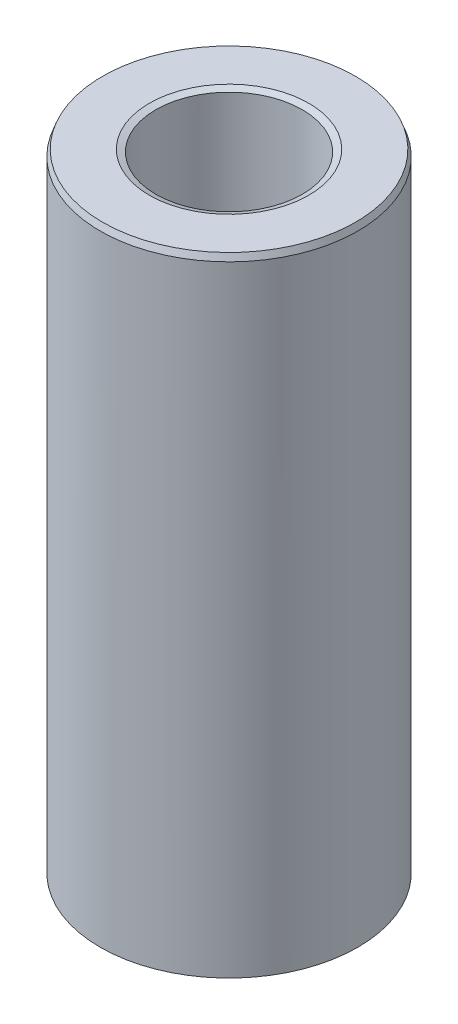
ISO-10303-21;
HEADER;
FILE_DESCRIPTION(('STEP AP214'),'2;1');
FILE_NAME('part.step','',(''),(''),'','','');
FILE_SCHEMA(('AUTOMOTIVE_DESIGN { 1 0 10303 214 1 1 1 1 }'));
ENDSEC;
DATA;
#1=APPLICATION_CONTEXT('core data for automotive mechanical design processes');
#2=APPLICATION_PROTOCOL_DEFINITION('international standard','automotive_design',2000,#1);
#3=PRODUCT_CONTEXT('',#1,'mechanical');
#4=PRODUCT('Part','Part','',(#3));
#5=PRODUCT_RELATED_PRODUCT_CATEGORY('part','',(#4));
#6=PRODUCT_DEFINITION_FORMATION('','',#4);
#7=PRODUCT_DEFINITION_CONTEXT('part definition',#1,'design');
#8=PRODUCT_DEFINITION('design','',#6,#7);
#9=PRODUCT_DEFINITION_SHAPE('','',#8);
#10=(LENGTH_UNIT() NAMED_UNIT(*) SI_UNIT(.MILLI.,.METRE.));
#11=(NAMED_UNIT(*) PLANE_ANGLE_UNIT() SI_UNIT($,.RADIAN.));
#12=(NAMED_UNIT(*) SI_UNIT($,.STERADIAN.) SOLID_ANGLE_UNIT());
#13=UNCERTAINTY_MEASURE_WITH_UNIT(LENGTH_MEASURE(1.E-05),#10,'distance_accuracy_value','');
#14=(GEOMETRIC_REPRESENTATION_CONTEXT(3) GLOBAL_UNCERTAINTY_ASSIGNED_CONTEXT((#13)) GLOBAL_UNIT_ASSIGNED_CONTEXT((#10,
#11,#12)) REPRESENTATION_CONTEXT('',''));
#15=CARTESIAN_POINT('',(0.,0.,0.));
#16=DIRECTION('',(0.,0.,1.));
#17=DIRECTION('',(1.,0.,0.));
#18=AXIS2_PLACEMENT_3D('',#15,#16,#17);
#19=CARTESIAN_POINT('',(0.,122.05267773114,0.));
#20=DIRECTION('',(0.,-1.,0.));
#21=DIRECTION('',(0.,0.,-1.));
#22=AXIS2_PLACEMENT_3D('',#19,#20,#21);
#23=CYLINDRICAL_SURFACE('',#22,25.);
#24=CARTESIAN_POINT('',(0.,0.462022938462175,0.));
#25=DIRECTION('',(0.,1.,0.));
#26=DIRECTION('',(0.,0.,1.));
#27=AXIS2_PLACEMENT_3D('',#24,#25,#26);
#28=CIRCLE('',#27,25.);
#29=CARTESIAN_POINT('',(0.,0.462022938462175,-25.));
#30=VERTEX_POINT('',#29);
#31=EDGE_CURVE('E10',#30,#30,#28,.T.);
#32=CARTESIAN_POINT('',(0.,120.804714833145,0.));
#33=DIRECTION('',(0.,1.,0.));
#34=DIRECTION('',(0.,0.,1.));
#35=AXIS2_PLACEMENT_3D('',#32,#33,#34);
#36=CIRCLE('',#35,25.);
#37=CARTESIAN_POINT('',(0.,120.804714833145,-25.));
#38=VERTEX_POINT('',#37);
#39=EDGE_CURVE('E50',#38,#38,#36,.F.);
#40=CARTESIAN_POINT('',(0.,0.462022938462175,-25.));
#41=CARTESIAN_POINT('',(0.,1.71559264569846,-25.));
#42=CARTESIAN_POINT('',(0.,2.96916235293473,-25.));
#43=CARTESIAN_POINT('',(0.,5.47630176740729,-25.));
#44=CARTESIAN_POINT('',(0.,6.72987147464356,-25.));
#45=CARTESIAN_POINT('',(0.,9.23701088911611,-25.));
#46=CARTESIAN_POINT('',(0.,10.4905805963524,-25.));
#47=CARTESIAN_POINT('',(0.,12.9977200108249,-25.));
#48=CARTESIAN_POINT('',(0.,14.2512897180612,-25.));
#49=CARTESIAN_POINT('',(0.,16.7584291325338,-25.));
#50=CARTESIAN_POINT('',(0.,18.0119988397701,-25.));
#51=CARTESIAN_POINT('',(0.,20.5191382542426,-25.));
#52=CARTESIAN_POINT('',(0.,21.7727079614789,-25.));
#53=CARTESIAN_POINT('',(0.,24.2798473759514,-25.));
#54=CARTESIAN_POINT('',(0.,25.5334170831877,-25.));
#55=CARTESIAN_POINT('',(0.,28.0405564976603,-25.));
#56=CARTESIAN_POINT('',(0.,29.2941262048965,-25.));
#57=CARTESIAN_POINT('',(0.,31.8012656193691,-25.));
#58=CARTESIAN_POINT('',(0.,33.0548353266054,-25.));
#59=CARTESIAN_POINT('',(0.,35.5619747410779,-25.));
#60=CARTESIAN_POINT('',(0.,36.8155444483142,-25.));
#61=CARTESIAN_POINT('',(0.,39.3226838627868,-25.));
#62=CARTESIAN_POINT('',(0.,40.576253570023,-25.));
#63=CARTESIAN_POINT('',(0.,43.0833929844956,-25.));
#64=CARTESIAN_POINT('',(0.,44.3369626917319,-25.));
#65=CARTESIAN_POINT('',(0.,46.8441021062044,-25.));
#66=CARTESIAN_POINT('',(0.,48.0976718134407,-25.));
#67=CARTESIAN_POINT('',(0.,50.6048112279133,-25.));
#68=CARTESIAN_POINT('',(0.,51.8583809351495,-25.));
#69=CARTESIAN_POINT('',(0.,54.3655203496221,-25.));
#70=CARTESIAN_POINT('',(0.,55.6190900568584,-25.));
#71=CARTESIAN_POINT('',(0.,58.1262294713309,-25.));
#72=CARTESIAN_POINT('',(0.,59.3797991785672,-25.));
#73=CARTESIAN_POINT('',(0.,61.8869385930398,-25.));
#74=CARTESIAN_POINT('',(0.,63.140508300276,-25.));
#75=CARTESIAN_POINT('',(0.,65.6476477147486,-25.));
#76=CARTESIAN_POINT('',(0.,66.9012174219849,-25.));
#77=CARTESIAN_POINT('',(0.,69.4083568364574,-25.));
#78=CARTESIAN_POINT('',(0.,70.6619265436937,-25.));
#79=CARTESIAN_POINT('',(0.,73.1690659581662,-25.));
#80=CARTESIAN_POINT('',(0.,74.4226356654025,-25.));
#81=CARTESIAN_POINT('',(0.,76.9297750798751,-25.));
#82=CARTESIAN_POINT('',(0.,78.1833447871114,-25.));
#83=CARTESIAN_POINT('',(0.,80.6904842015839,-25.));
#84=CARTESIAN_POINT('',(0.,81.9440539088202,-25.));
#85=CARTESIAN_POINT('',(0.,84.4511933232927,-25.));
#86=CARTESIAN_POINT('',(0.,85.704763030529,-25.));
#87=CARTESIAN_POINT('',(0.,88.2119024450016,-25.));
#88=CARTESIAN_POINT('',(0.,89.4654721522379,-25.));
#89=CARTESIAN_POINT('',(0.,91.9726115667104,-25.));
#90=CARTESIAN_POINT('',(0.,93.2261812739467,-25.));
#91=CARTESIAN_POINT('',(0.,95.7333206884192,-25.));
#92=CARTESIAN_POINT('',(0.,96.9868903956555,-25.));
#93=CARTESIAN_POINT('',(0.,99.4940298101281,-25.));
#94=CARTESIAN_POINT('',(0.,100.747599517364,-25.));
#95=CARTESIAN_POINT('',(0.,103.254738931837,-25.));
#96=CARTESIAN_POINT('',(0.,104.508308639073,-25.));
#97=CARTESIAN_POINT('',(0.,107.015448053546,-25.));
#98=CARTESIAN_POINT('',(0.,108.269017760782,-25.));
#99=CARTESIAN_POINT('',(0.,110.776157175255,-25.));
#100=CARTESIAN_POINT('',(0.,112.029726882491,-25.));
#101=CARTESIAN_POINT('',(0.,114.536866296963,-25.));
#102=CARTESIAN_POINT('',(0.,115.7904360042,-25.));
#103=CARTESIAN_POINT('',(0.,118.297575418672,-25.));
#104=CARTESIAN_POINT('',(0.,119.551145125908,-25.));
#105=CARTESIAN_POINT('',(0.,120.804714833145,-25.));
#106=B_SPLINE_CURVE_WITH_KNOTS('',3,(#40,#41,#42,#43,#44,#45,#46,#47,#48,#49,#50,#51,#52,#53,
#54,#55,#56,#57,#58,#59,#60,#61,#62,#63,#64,#65,#66,#67,#68,#69,#70,#71,#72,#73,#74,#75,#76,#77,
#78,#79,#80,#81,#82,#83,#84,#85,#86,#87,#88,#89,#90,#91,#92,#93,#94,#95,#96,#97,#98,#99,#100,
#101,#102,#103,#104,#105),.UNSPECIFIED.,.F.,.F.,(4,2,2,2,2,2,2,2,2,2,2,2,2,2,2,2,2,2,2,2,2,2,2,
2,2,2,2,2,2,2,2,2,4),(0.,3.76070912170884,7.52141824341766,11.2821273651265,15.0428364868353,
18.8035456085442,22.564254730253,26.3249638519618,30.0856729736707,33.8463820953795,
37.6070912170883,41.3678003387971,45.128509460506,48.8892185822148,52.6499277039236,
56.4106368256325,60.1713459473413,63.9320550690501,67.692764190759,71.4534733124678,
75.2141824341766,78.9748915558855,82.7356006775943,86.4963097993031,90.257018921012,
94.0177280427208,97.7784371644296,101.539146286138,105.299855407847,109.060564529556,
112.821273651265,116.581982772974,120.342691894683),.UNSPECIFIED.);
#107=EDGE_CURVE('BSEAM39',#30,#38,#106,.T.);
#108=ORIENTED_EDGE('',*,*,#31,.T.);
#109=ORIENTED_EDGE('',*,*,#39,.T.);
#110=ORIENTED_EDGE('',*,*,#107,.T.);
#111=ORIENTED_EDGE('',*,*,#107,.F.);
#112=EDGE_LOOP('',(#108,#110,#109,#111));
#113=FACE_BOUND('',#112,.T.);
#114=ADVANCED_FACE('F39',(#113),#23,.T.);
#115=CARTESIAN_POINT('',(0.,122.05267773114,0.));
#116=DIRECTION('',(0.,1.,0.));
#117=DIRECTION('',(0.,0.,1.));
#118=AXIS2_PLACEMENT_3D('',#115,#116,#117);
#119=PLANE('',#118);
#120=CARTESIAN_POINT('',(0.,122.05267773114,0.));
#121=DIRECTION('',(0.,1.,0.));
#122=DIRECTION('',(0.,0.,1.));
#123=AXIS2_PLACEMENT_3D('',#120,#121,#122);
#124=CIRCLE('',#123,15.4677326801847);
#125=CARTESIAN_POINT('',(0.,122.05267773114,15.4677326801847));
#126=VERTEX_POINT('',#125);
#127=EDGE_CURVE('E58',#126,#126,#124,.F.);
#128=ORIENTED_EDGE('',*,*,#127,.T.);
#129=EDGE_LOOP('',(#128));
#130=FACE_BOUND('',#129,.T.);
#131=CARTESIAN_POINT('',(0.,122.05267773114,0.));
#132=DIRECTION('',(0.,1.,0.));
#133=DIRECTION('',(0.,0.,1.));
#134=AXIS2_PLACEMENT_3D('',#131,#132,#133);
#135=CIRCLE('',#134,24.537977061538);
#136=CARTESIAN_POINT('',(0.,122.05267773114,24.537977061538));
#137=VERTEX_POINT('',#136);
#138=EDGE_CURVE('E61',#137,#137,#135,.T.);
#139=ORIENTED_EDGE('',*,*,#138,.T.);
#140=EDGE_LOOP('',(#139));
#141=FACE_BOUND('',#140,.T.);
#142=ADVANCED_FACE('F88',(#130,#141),#119,.T.);
#143=CARTESIAN_POINT('',(0.,0.,0.));
#144=DIRECTION('',(0.,1.,0.));
#145=DIRECTION('',(0.,0.,1.));
#146=AXIS2_PLACEMENT_3D('',#143,#144,#145);
#147=PLANE('',#146);
#148=CARTESIAN_POINT('',(0.,0.,0.));
#149=DIRECTION('',(0.,1.,0.));
#150=DIRECTION('',(0.,0.,1.));
#151=AXIS2_PLACEMENT_3D('',#148,#149,#150);
#152=CIRCLE('',#151,14.6817927206512);
#153=CARTESIAN_POINT('',(0.,0.,14.6817927206512));
#154=VERTEX_POINT('',#153);
#155=EDGE_CURVE('E51',#154,#154,#152,.T.);
#156=ORIENTED_EDGE('',*,*,#155,.T.);
#157=EDGE_LOOP('',(#156));
#158=FACE_BOUND('',#157,.T.);
#159=CARTESIAN_POINT('',(0.,0.,0.));
#160=DIRECTION('',(0.,1.,0.));
#161=DIRECTION('',(0.,0.,1.));
#162=AXIS2_PLACEMENT_3D('',#159,#160,#161);
#163=CIRCLE('',#162,23.7520371020044);
#164=CARTESIAN_POINT('',(0.,0.,23.7520371020044));
#165=VERTEX_POINT('',#164);
#166=EDGE_CURVE('E54',#165,#165,#163,.F.);
#167=ORIENTED_EDGE('',*,*,#166,.T.);
#168=EDGE_LOOP('',(#167));
#169=FACE_BOUND('',#168,.T.);
#170=ADVANCED_FACE('F83',(#158,#169),#147,.F.);
#171=CARTESIAN_POINT('',(0.,122.05267773114,0.));
#172=DIRECTION('',(0.,-1.,0.));
#173=DIRECTION('',(0.,0.,-1.));
#174=AXIS2_PLACEMENT_3D('',#171,#172,#173);
#175=CYLINDRICAL_SURFACE('',#174,14.2197697821891);
#176=CARTESIAN_POINT('',(0.,121.590654792678,0.));
#177=DIRECTION('',(0.,1.,0.));
#178=DIRECTION('',(0.,0.,1.));
#179=AXIS2_PLACEMENT_3D('',#176,#177,#178);
#180=CIRCLE('',#179,14.2197697821891);
#181=CARTESIAN_POINT('',(0.,121.590654792678,-14.2197697821891));
#182=VERTEX_POINT('',#181);
#183=EDGE_CURVE('E67',#182,#182,#180,.T.);
#184=CARTESIAN_POINT('',(0.,1.2479628979955,0.));
#185=DIRECTION('',(0.,1.,0.));
#186=DIRECTION('',(0.,0.,1.));
#187=AXIS2_PLACEMENT_3D('',#184,#185,#186);
#188=CIRCLE('',#187,14.2197697821891);
#189=CARTESIAN_POINT('',(0.,1.2479628979955,-14.2197697821891));
#190=VERTEX_POINT('',#189);
#191=EDGE_CURVE('E69',#190,#190,#188,.F.);
#192=CARTESIAN_POINT('',(0.,121.590654792678,-14.2197697821891));
#193=CARTESIAN_POINT('',(0.,120.337085085442,-14.2197697821891));
#194=CARTESIAN_POINT('',(0.,119.083515378205,-14.2197697821891));
#195=CARTESIAN_POINT('',(0.,116.576375963733,-14.2197697821891));
#196=CARTESIAN_POINT('',(0.,115.322806256496,-14.2197697821891));
#197=CARTESIAN_POINT('',(0.,112.815666842024,-14.2197697821891));
#198=CARTESIAN_POINT('',(0.,111.562097134788,-14.2197697821891));
#199=CARTESIAN_POINT('',(0.,109.054957720315,-14.2197697821891));
#200=CARTESIAN_POINT('',(0.,107.801388013079,-14.2197697821891));
#201=CARTESIAN_POINT('',(0.,105.294248598606,-14.2197697821891));
#202=CARTESIAN_POINT('',(0.,104.04067889137,-14.2197697821891));
#203=CARTESIAN_POINT('',(0.,101.533539476897,-14.2197697821891));
#204=CARTESIAN_POINT('',(0.,100.279969769661,-14.2197697821891));
#205=CARTESIAN_POINT('',(0.,97.7728303551886,-14.2197697821891));
#206=CARTESIAN_POINT('',(0.,96.5192606479523,-14.2197697821891));
#207=CARTESIAN_POINT('',(0.,94.0121212334798,-14.2197697821891));
#208=CARTESIAN_POINT('',(0.,92.7585515262435,-14.2197697821891));
#209=CARTESIAN_POINT('',(0.,90.2514121117709,-14.2197697821891));
#210=CARTESIAN_POINT('',(0.,88.9978424045347,-14.2197697821891));
#211=CARTESIAN_POINT('',(0.,86.4907029900621,-14.2197697821891));
#212=CARTESIAN_POINT('',(0.,85.2371332828259,-14.2197697821891));
#213=CARTESIAN_POINT('',(0.,82.7299938683533,-14.2197697821891));
#214=CARTESIAN_POINT('',(0.,81.476424161117,-14.2197697821891));
#215=CARTESIAN_POINT('',(0.,78.9692847466445,-14.2197697821891));
#216=CARTESIAN_POINT('',(0.,77.7157150394082,-14.2197697821891));
#217=CARTESIAN_POINT('',(0.,75.2085756249356,-14.2197697821891));
#218=CARTESIAN_POINT('',(0.,73.9550059176994,-14.2197697821891));
#219=CARTESIAN_POINT('',(0.,71.4478665032268,-14.2197697821891));
#220=CARTESIAN_POINT('',(0.,70.1942967959906,-14.2197697821891));
#221=CARTESIAN_POINT('',(0.,67.687157381518,-14.2197697821891));
#222=CARTESIAN_POINT('',(0.,66.4335876742817,-14.2197697821891));
#223=CARTESIAN_POINT('',(0.,63.9264482598092,-14.2197697821891));
#224=CARTESIAN_POINT('',(0.,62.6728785525729,-14.2197697821891));
#225=CARTESIAN_POINT('',(0.,60.1657391381004,-14.2197697821891));
#226=CARTESIAN_POINT('',(0.,58.9121694308641,-14.2197697821891));
#227=CARTESIAN_POINT('',(0.,56.4050300163915,-14.2197697821891));
#228=CARTESIAN_POINT('',(0.,55.1514603091553,-14.2197697821891));
#229=CARTESIAN_POINT('',(0.,52.6443208946827,-14.2197697821891));
#230=CARTESIAN_POINT('',(0.,51.3907511874465,-14.2197697821891));
#231=CARTESIAN_POINT('',(0.,48.8836117729739,-14.2197697821891));
#232=CARTESIAN_POINT('',(0.,47.6300420657376,-14.2197697821891));
#233=CARTESIAN_POINT('',(0.,45.1229026512651,-14.2197697821891));
#234=CARTESIAN_POINT('',(0.,43.8693329440288,-14.2197697821891));
#235=CARTESIAN_POINT('',(0.,41.3621935295563,-14.2197697821891));
#236=CARTESIAN_POINT('',(0.,40.10862382232,-14.2197697821891));
#237=CARTESIAN_POINT('',(0.,37.6014844078474,-14.2197697821891));
#238=CARTESIAN_POINT('',(0.,36.3479147006112,-14.2197697821891));
#239=CARTESIAN_POINT('',(0.,33.8407752861386,-14.2197697821891));
#240=CARTESIAN_POINT('',(0.,32.5872055789023,-14.2197697821891));
#241=CARTESIAN_POINT('',(0.,30.0800661644298,-14.2197697821891));
#242=CARTESIAN_POINT('',(0.,28.8264964571935,-14.2197697821891));
#243=CARTESIAN_POINT('',(0.,26.319357042721,-14.2197697821891));
#244=CARTESIAN_POINT('',(0.,25.0657873354847,-14.2197697821891));
#245=CARTESIAN_POINT('',(0.,22.5586479210122,-14.2197697821891));
#246=CARTESIAN_POINT('',(0.,21.3050782137759,-14.2197697821891));
#247=CARTESIAN_POINT('',(0.,18.7979387993033,-14.2197697821891));
#248=CARTESIAN_POINT('',(0.,17.5443690920671,-14.2197697821891));
#249=CARTESIAN_POINT('',(0.,15.0372296775945,-14.2197697821891));
#250=CARTESIAN_POINT('',(0.,13.7836599703582,-14.2197697821891));
#251=CARTESIAN_POINT('',(0.,11.2765205558857,-14.2197697821891));
#252=CARTESIAN_POINT('',(0.,10.0229508486494,-14.2197697821891));
#253=CARTESIAN_POINT('',(0.,7.51581143417687,-14.2197697821891));
#254=CARTESIAN_POINT('',(0.,6.26224172694059,-14.2197697821891));
#255=CARTESIAN_POINT('',(0.,3.75510231246804,-14.2197697821891));
#256=CARTESIAN_POINT('',(0.,2.50153260523177,-14.2197697821891));
#257=CARTESIAN_POINT('',(0.,1.2479628979955,-14.2197697821891));
#258=B_SPLINE_CURVE_WITH_KNOTS('',3,(#192,#193,#194,#195,#196,#197,#198,#199,#200,#201,#202,
#203,#204,#205,#206,#207,#208,#209,#210,#211,#212,#213,#214,#215,#216,#217,#218,#219,#220,#221,
#222,#223,#224,#225,#226,#227,#228,#229,#230,#231,#232,#233,#234,#235,#236,#237,#238,#239,#240,
#241,#242,#243,#244,#245,#246,#247,#248,#249,#250,#251,#252,#253,#254,#255,#256,#257),
.UNSPECIFIED.,.F.,.F.,(4,2,2,2,2,2,2,2,2,2,2,2,2,2,2,2,2,2,2,2,2,2,2,2,2,2,2,2,2,2,2,2,4),(0.,
3.76070912170882,7.52141824341765,11.2821273651265,15.0428364868353,18.8035456085441,
22.5642547302529,26.3249638519618,30.0856729736706,33.8463820953794,37.6070912170882,
41.367800338797,45.1285094605059,48.8892185822147,52.6499277039235,56.4106368256323,
60.1713459473412,63.93205506905,67.6927641907588,71.4534733124676,75.2141824341764,
78.9748915558853,82.7356006775941,86.4963097993029,90.2570189210117,94.0177280427205,
97.7784371644294,101.539146286138,105.299855407847,109.060564529556,112.821273651265,
116.581982772973,120.342691894682),.UNSPECIFIED.);
#259=EDGE_CURVE('BSEAM71',#182,#190,#258,.T.);
#260=ORIENTED_EDGE('',*,*,#183,.T.);
#261=ORIENTED_EDGE('',*,*,#191,.T.);
#262=ORIENTED_EDGE('',*,*,#259,.T.);
#263=ORIENTED_EDGE('',*,*,#259,.F.);
#264=EDGE_LOOP('',(#260,#262,#261,#263));
#265=FACE_BOUND('',#264,.T.);
#266=ADVANCED_FACE('F71',(#265),#175,.F.);
#267=CARTESIAN_POINT('',(0.,121.590654792678,0.));
#268=DIRECTION('',(0.,1.,0.));
#269=DIRECTION('',(0.,0.,1.));
#270=AXIS2_PLACEMENT_3D('',#267,#268,#269);
#271=CONICAL_SURFACE('',#270,14.2197697821891,1.21622142283789);
#272=ORIENTED_EDGE('',*,*,#127,.F.);
#273=EDGE_LOOP('',(#272));
#274=FACE_BOUND('',#273,.T.);
#275=ORIENTED_EDGE('',*,*,#183,.F.);
#276=EDGE_LOOP('',(#275));
#277=FACE_BOUND('',#276,.T.);
#278=ADVANCED_FACE('F77',(#274,#277),#271,.F.);
#279=CARTESIAN_POINT('',(0.,0.,0.));
#280=DIRECTION('',(0.,-1.,0.));
#281=DIRECTION('',(0.,0.,-1.));
#282=AXIS2_PLACEMENT_3D('',#279,#280,#281);
#283=CONICAL_SURFACE('',#282,14.6817927206512,0.354574903956992);
#284=ORIENTED_EDGE('',*,*,#191,.F.);
#285=EDGE_LOOP('',(#284));
#286=FACE_BOUND('',#285,.T.);
#287=ORIENTED_EDGE('',*,*,#155,.F.);
#288=EDGE_LOOP('',(#287));
#289=FACE_BOUND('',#288,.T.);
#290=ADVANCED_FACE('F73',(#286,#289),#283,.F.);
#291=CARTESIAN_POINT('',(0.,0.462022938462175,0.));
#292=DIRECTION('',(0.,1.,0.));
#293=DIRECTION('',(0.,0.,1.));
#294=AXIS2_PLACEMENT_3D('',#291,#292,#293);
#295=CONICAL_SURFACE('',#294,25.,1.2162214228379);
#296=ORIENTED_EDGE('',*,*,#166,.F.);
#297=EDGE_LOOP('',(#296));
#298=FACE_BOUND('',#297,.T.);
#299=ORIENTED_EDGE('',*,*,#31,.F.);
#300=EDGE_LOOP('',(#299));
#301=FACE_BOUND('',#300,.T.);
#302=ADVANCED_FACE('F76',(#298,#301),#295,.T.);
#303=CARTESIAN_POINT('',(0.,122.05267773114,0.));
#304=DIRECTION('',(0.,-1.,0.));
#305=DIRECTION('',(0.,0.,-1.));
#306=AXIS2_PLACEMENT_3D('',#303,#304,#305);
#307=CONICAL_SURFACE('',#306,24.537977061538,0.354574903956995);
#308=ORIENTED_EDGE('',*,*,#39,.F.);
#309=EDGE_LOOP('',(#308));
#310=FACE_BOUND('',#309,.T.);
#311=ORIENTED_EDGE('',*,*,#138,.F.);
#312=EDGE_LOOP('',(#311));
#313=FACE_BOUND('',#312,.T.);
#314=ADVANCED_FACE('F45',(#310,#313),#307,.T.);
#315=CLOSED_SHELL('',(#114,#142,#170,#266,#278,#290,#302,#314));
#316=MANIFOLD_SOLID_BREP('B2',#315);
#317=ADVANCED_BREP_SHAPE_REPRESENTATION('',(#18,#316),#14);
#318=SHAPE_DEFINITION_REPRESENTATION(#9,#317);
ENDSEC;
END-ISO-10303-21;
